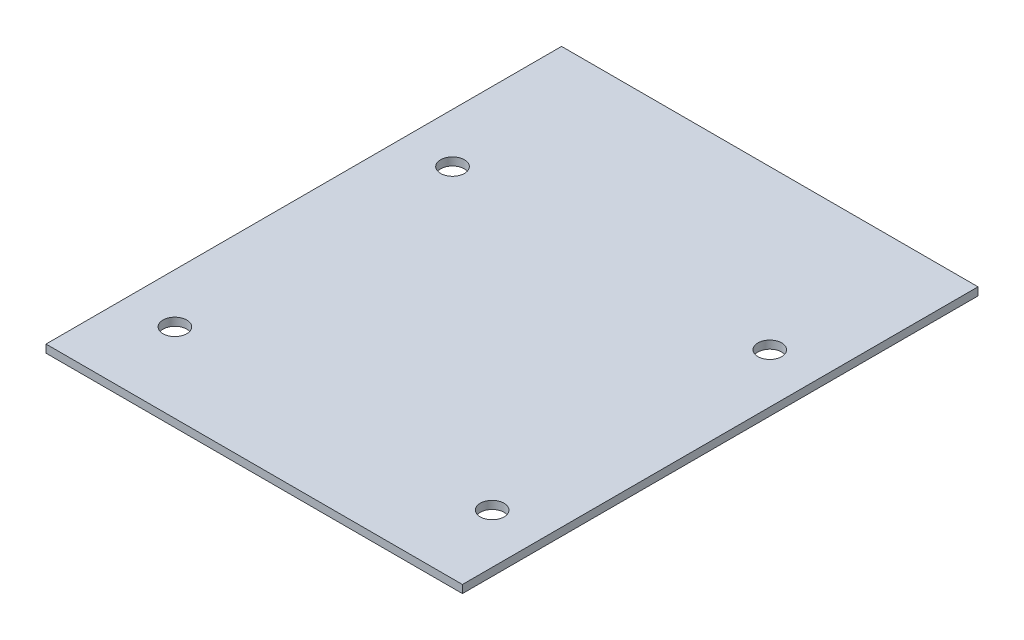
ISO-10303-21;
HEADER;
FILE_DESCRIPTION(('STEP AP214'),'2;1');
FILE_NAME('part.step','',(''),(''),'','','');
FILE_SCHEMA(('AUTOMOTIVE_DESIGN { 1 0 10303 214 1 1 1 1 }'));
ENDSEC;
DATA;
#1=APPLICATION_CONTEXT('core data for automotive mechanical design processes');
#2=APPLICATION_PROTOCOL_DEFINITION('international standard','automotive_design',2000,#1);
#3=PRODUCT_CONTEXT('',#1,'mechanical');
#4=PRODUCT('Part','Part','',(#3));
#5=PRODUCT_RELATED_PRODUCT_CATEGORY('part','',(#4));
#6=PRODUCT_DEFINITION_FORMATION('','',#4);
#7=PRODUCT_DEFINITION_CONTEXT('part definition',#1,'design');
#8=PRODUCT_DEFINITION('design','',#6,#7);
#9=PRODUCT_DEFINITION_SHAPE('','',#8);
#10=(LENGTH_UNIT() NAMED_UNIT(*) SI_UNIT(.MILLI.,.METRE.));
#11=(NAMED_UNIT(*) PLANE_ANGLE_UNIT() SI_UNIT($,.RADIAN.));
#12=(NAMED_UNIT(*) SI_UNIT($,.STERADIAN.) SOLID_ANGLE_UNIT());
#13=UNCERTAINTY_MEASURE_WITH_UNIT(LENGTH_MEASURE(1.E-05),#10,'distance_accuracy_value','');
#14=(GEOMETRIC_REPRESENTATION_CONTEXT(3) GLOBAL_UNCERTAINTY_ASSIGNED_CONTEXT((#13)) GLOBAL_UNIT_ASSIGNED_CONTEXT((#10,
#11,#12)) REPRESENTATION_CONTEXT('',''));
#15=CARTESIAN_POINT('',(0.,0.,0.));
#16=DIRECTION('',(0.,0.,1.));
#17=DIRECTION('',(1.,0.,0.));
#18=AXIS2_PLACEMENT_3D('',#15,#16,#17);
#19=CARTESIAN_POINT('',(105.,553.,405.));
#20=DIRECTION('',(1.,0.,0.));
#21=DIRECTION('',(0.,0.,-1.));
#22=AXIS2_PLACEMENT_3D('',#19,#20,#21);
#23=PLANE('',#22);
#24=DIRECTION('',(0.,1.,0.));
#25=VECTOR('',#24,1.);
#26=CARTESIAN_POINT('',(105.,553.,405.));
#27=LINE('',#26,#25);
#28=CARTESIAN_POINT('',(105.,549.,405.));
#29=VERTEX_POINT('',#28);
#30=CARTESIAN_POINT('',(105.,553.,405.));
#31=VERTEX_POINT('',#30);
#32=EDGE_CURVE('E11',#29,#31,#27,.T.);
#33=ORIENTED_EDGE('',*,*,#32,.F.);
#34=DIRECTION('',(0.,0.,1.));
#35=VECTOR('',#34,1.);
#36=CARTESIAN_POINT('',(105.,549.,0.));
#37=LINE('',#36,#35);
#38=CARTESIAN_POINT('',(105.,549.,145.));
#39=VERTEX_POINT('',#38);
#40=EDGE_CURVE('E91',#29,#39,#37,.F.);
#41=ORIENTED_EDGE('',*,*,#40,.T.);
#42=DIRECTION('',(0.,1.,0.));
#43=VECTOR('',#42,1.);
#44=CARTESIAN_POINT('',(105.,553.,145.));
#45=LINE('',#44,#43);
#46=CARTESIAN_POINT('',(105.,553.,145.));
#47=VERTEX_POINT('',#46);
#48=EDGE_CURVE('E47',#39,#47,#45,.T.);
#49=ORIENTED_EDGE('',*,*,#48,.T.);
#50=DIRECTION('',(0.,0.,-1.));
#51=VECTOR('',#50,1.);
#52=CARTESIAN_POINT('',(105.,553.,405.));
#53=LINE('',#52,#51);
#54=EDGE_CURVE('E107',#31,#47,#53,.T.);
#55=ORIENTED_EDGE('',*,*,#54,.F.);
#56=EDGE_LOOP('',(#33,#41,#49,#55));
#57=FACE_BOUND('',#56,.T.);
#58=ADVANCED_FACE('F37',(#57),#23,.T.);
#59=CARTESIAN_POINT('',(105.,553.,145.));
#60=DIRECTION('',(0.,0.,-1.));
#61=DIRECTION('',(-1.,0.,0.));
#62=AXIS2_PLACEMENT_3D('',#59,#60,#61);
#63=PLANE('',#62);
#64=ORIENTED_EDGE('',*,*,#48,.F.);
#65=DIRECTION('',(1.,0.,0.));
#66=VECTOR('',#65,1.);
#67=CARTESIAN_POINT('',(0.,549.,145.));
#68=LINE('',#67,#66);
#69=CARTESIAN_POINT('',(-105.,549.,145.));
#70=VERTEX_POINT('',#69);
#71=EDGE_CURVE('E101',#39,#70,#68,.F.);
#72=ORIENTED_EDGE('',*,*,#71,.T.);
#73=DIRECTION('',(0.,1.,0.));
#74=VECTOR('',#73,1.);
#75=CARTESIAN_POINT('',(-105.,553.,145.));
#76=LINE('',#75,#74);
#77=CARTESIAN_POINT('',(-105.,553.,145.));
#78=VERTEX_POINT('',#77);
#79=EDGE_CURVE('E55',#70,#78,#76,.T.);
#80=ORIENTED_EDGE('',*,*,#79,.T.);
#81=DIRECTION('',(-1.,0.,0.));
#82=VECTOR('',#81,1.);
#83=CARTESIAN_POINT('',(105.,553.,145.));
#84=LINE('',#83,#82);
#85=EDGE_CURVE('E85',#47,#78,#84,.T.);
#86=ORIENTED_EDGE('',*,*,#85,.F.);
#87=EDGE_LOOP('',(#64,#72,#80,#86));
#88=FACE_BOUND('',#87,.T.);
#89=ADVANCED_FACE('F112',(#88),#63,.T.);
#90=CARTESIAN_POINT('',(-105.,553.,405.));
#91=DIRECTION('',(-1.,0.,0.));
#92=DIRECTION('',(0.,0.,1.));
#93=AXIS2_PLACEMENT_3D('',#90,#91,#92);
#94=PLANE('',#93);
#95=ORIENTED_EDGE('',*,*,#79,.F.);
#96=DIRECTION('',(0.,0.,1.));
#97=VECTOR('',#96,1.);
#98=CARTESIAN_POINT('',(-105.,549.,0.));
#99=LINE('',#98,#97);
#100=CARTESIAN_POINT('',(-105.,549.,405.));
#101=VERTEX_POINT('',#100);
#102=EDGE_CURVE('E90',#70,#101,#99,.T.);
#103=ORIENTED_EDGE('',*,*,#102,.T.);
#104=DIRECTION('',(0.,1.,0.));
#105=VECTOR('',#104,1.);
#106=CARTESIAN_POINT('',(-105.,553.,405.));
#107=LINE('',#106,#105);
#108=CARTESIAN_POINT('',(-105.,553.,405.));
#109=VERTEX_POINT('',#108);
#110=EDGE_CURVE('E41',#101,#109,#107,.T.);
#111=ORIENTED_EDGE('',*,*,#110,.T.);
#112=DIRECTION('',(0.,0.,1.));
#113=VECTOR('',#112,1.);
#114=CARTESIAN_POINT('',(-105.,553.,405.));
#115=LINE('',#114,#113);
#116=EDGE_CURVE('E179',#78,#109,#115,.T.);
#117=ORIENTED_EDGE('',*,*,#116,.F.);
#118=EDGE_LOOP('',(#95,#103,#111,#117));
#119=FACE_BOUND('',#118,.T.);
#120=ADVANCED_FACE('F93',(#119),#94,.T.);
#121=CARTESIAN_POINT('',(-80.,553.,225.));
#122=DIRECTION('',(0.,1.,0.));
#123=DIRECTION('',(0.,0.,1.));
#124=AXIS2_PLACEMENT_3D('',#121,#122,#123);
#125=CYLINDRICAL_SURFACE('',#124,5.99999999999989);
#126=CARTESIAN_POINT('',(-80.,553.,225.));
#127=DIRECTION('',(0.,1.,0.));
#128=DIRECTION('',(0.,0.,1.));
#129=AXIS2_PLACEMENT_3D('',#126,#127,#128);
#130=CIRCLE('',#129,5.99999999999989);
#131=CARTESIAN_POINT('',(-80.,553.,231.));
#132=VERTEX_POINT('',#131);
#133=EDGE_CURVE('E103',#132,#132,#130,.T.);
#134=ORIENTED_EDGE('',*,*,#133,.T.);
#135=EDGE_LOOP('',(#134));
#136=FACE_BOUND('',#135,.T.);
#137=CARTESIAN_POINT('',(-80.,549.,225.));
#138=DIRECTION('',(0.,1.,0.));
#139=DIRECTION('',(0.,0.,1.));
#140=AXIS2_PLACEMENT_3D('',#137,#138,#139);
#141=CIRCLE('',#140,5.99999999999989);
#142=CARTESIAN_POINT('',(-80.,549.,231.));
#143=VERTEX_POINT('',#142);
#144=EDGE_CURVE('E116',#143,#143,#141,.T.);
#145=ORIENTED_EDGE('',*,*,#144,.F.);
#146=EDGE_LOOP('',(#145));
#147=FACE_BOUND('',#146,.T.);
#148=ADVANCED_FACE('F138',(#136,#147),#125,.F.);
#149=CARTESIAN_POINT('',(80.,553.,225.));
#150=DIRECTION('',(0.,1.,0.));
#151=DIRECTION('',(0.,0.,1.));
#152=AXIS2_PLACEMENT_3D('',#149,#150,#151);
#153=CYLINDRICAL_SURFACE('',#152,5.99999999999989);
#154=CARTESIAN_POINT('',(80.,553.,225.));
#155=DIRECTION('',(0.,1.,0.));
#156=DIRECTION('',(0.,0.,1.));
#157=AXIS2_PLACEMENT_3D('',#154,#155,#156);
#158=CIRCLE('',#157,5.99999999999989);
#159=CARTESIAN_POINT('',(80.,553.,231.));
#160=VERTEX_POINT('',#159);
#161=EDGE_CURVE('E172',#160,#160,#158,.T.);
#162=ORIENTED_EDGE('',*,*,#161,.T.);
#163=EDGE_LOOP('',(#162));
#164=FACE_BOUND('',#163,.T.);
#165=CARTESIAN_POINT('',(80.,549.,225.));
#166=DIRECTION('',(0.,1.,0.));
#167=DIRECTION('',(0.,0.,1.));
#168=AXIS2_PLACEMENT_3D('',#165,#166,#167);
#169=CIRCLE('',#168,5.99999999999989);
#170=CARTESIAN_POINT('',(80.,549.,231.));
#171=VERTEX_POINT('',#170);
#172=EDGE_CURVE('E119',#171,#171,#169,.T.);
#173=ORIENTED_EDGE('',*,*,#172,.F.);
#174=EDGE_LOOP('',(#173));
#175=FACE_BOUND('',#174,.T.);
#176=ADVANCED_FACE('F129',(#164,#175),#153,.F.);
#177=CARTESIAN_POINT('',(80.,553.,365.));
#178=DIRECTION('',(0.,1.,0.));
#179=DIRECTION('',(0.,0.,1.));
#180=AXIS2_PLACEMENT_3D('',#177,#178,#179);
#181=CYLINDRICAL_SURFACE('',#180,5.99999999999989);
#182=CARTESIAN_POINT('',(80.,553.,365.));
#183=DIRECTION('',(0.,1.,0.));
#184=DIRECTION('',(0.,0.,1.));
#185=AXIS2_PLACEMENT_3D('',#182,#183,#184);
#186=CIRCLE('',#185,5.99999999999989);
#187=CARTESIAN_POINT('',(80.,553.,371.));
#188=VERTEX_POINT('',#187);
#189=EDGE_CURVE('E175',#188,#188,#186,.T.);
#190=ORIENTED_EDGE('',*,*,#189,.T.);
#191=EDGE_LOOP('',(#190));
#192=FACE_BOUND('',#191,.T.);
#193=CARTESIAN_POINT('',(80.,549.,365.));
#194=DIRECTION('',(0.,1.,0.));
#195=DIRECTION('',(0.,0.,1.));
#196=AXIS2_PLACEMENT_3D('',#193,#194,#195);
#197=CIRCLE('',#196,5.99999999999989);
#198=CARTESIAN_POINT('',(80.,549.,371.));
#199=VERTEX_POINT('',#198);
#200=EDGE_CURVE('E97',#199,#199,#197,.T.);
#201=ORIENTED_EDGE('',*,*,#200,.F.);
#202=EDGE_LOOP('',(#201));
#203=FACE_BOUND('',#202,.T.);
#204=ADVANCED_FACE('F126',(#192,#203),#181,.F.);
#205=CARTESIAN_POINT('',(-80.,553.,365.));
#206=DIRECTION('',(0.,1.,0.));
#207=DIRECTION('',(0.,0.,1.));
#208=AXIS2_PLACEMENT_3D('',#205,#206,#207);
#209=CYLINDRICAL_SURFACE('',#208,5.99999999999989);
#210=CARTESIAN_POINT('',(-80.,553.,365.));
#211=DIRECTION('',(0.,1.,0.));
#212=DIRECTION('',(0.,0.,1.));
#213=AXIS2_PLACEMENT_3D('',#210,#211,#212);
#214=CIRCLE('',#213,5.99999999999989);
#215=CARTESIAN_POINT('',(-80.,553.,371.));
#216=VERTEX_POINT('',#215);
#217=EDGE_CURVE('E178',#216,#216,#214,.T.);
#218=ORIENTED_EDGE('',*,*,#217,.T.);
#219=EDGE_LOOP('',(#218));
#220=FACE_BOUND('',#219,.T.);
#221=CARTESIAN_POINT('',(-80.,549.,365.));
#222=DIRECTION('',(0.,1.,0.));
#223=DIRECTION('',(0.,0.,1.));
#224=AXIS2_PLACEMENT_3D('',#221,#222,#223);
#225=CIRCLE('',#224,5.99999999999989);
#226=CARTESIAN_POINT('',(-80.,549.,371.));
#227=VERTEX_POINT('',#226);
#228=EDGE_CURVE('E94',#227,#227,#225,.T.);
#229=ORIENTED_EDGE('',*,*,#228,.F.);
#230=EDGE_LOOP('',(#229));
#231=FACE_BOUND('',#230,.T.);
#232=ADVANCED_FACE('F128',(#220,#231),#209,.F.);
#233=CARTESIAN_POINT('',(105.,553.,405.));
#234=DIRECTION('',(0.,0.,1.));
#235=DIRECTION('',(1.,0.,0.));
#236=AXIS2_PLACEMENT_3D('',#233,#234,#235);
#237=PLANE('',#236);
#238=DIRECTION('',(1.,0.,0.));
#239=VECTOR('',#238,1.);
#240=CARTESIAN_POINT('',(0.,549.,405.));
#241=LINE('',#240,#239);
#242=EDGE_CURVE('E79',#101,#29,#241,.T.);
#243=ORIENTED_EDGE('',*,*,#242,.T.);
#244=ORIENTED_EDGE('',*,*,#32,.T.);
#245=DIRECTION('',(1.,0.,0.));
#246=VECTOR('',#245,1.);
#247=CARTESIAN_POINT('',(105.,553.,405.));
#248=LINE('',#247,#246);
#249=EDGE_CURVE('E81',#109,#31,#248,.T.);
#250=ORIENTED_EDGE('',*,*,#249,.F.);
#251=ORIENTED_EDGE('',*,*,#110,.F.);
#252=EDGE_LOOP('',(#243,#244,#250,#251));
#253=FACE_BOUND('',#252,.T.);
#254=ADVANCED_FACE('F39',(#253),#237,.T.);
#255=CARTESIAN_POINT('',(0.,553.,0.));
#256=DIRECTION('',(0.,1.,0.));
#257=DIRECTION('',(0.,0.,1.));
#258=AXIS2_PLACEMENT_3D('',#255,#256,#257);
#259=PLANE('',#258);
#260=ORIENTED_EDGE('',*,*,#133,.F.);
#261=EDGE_LOOP('',(#260));
#262=FACE_BOUND('',#261,.T.);
#263=ORIENTED_EDGE('',*,*,#161,.F.);
#264=EDGE_LOOP('',(#263));
#265=FACE_BOUND('',#264,.T.);
#266=ORIENTED_EDGE('',*,*,#189,.F.);
#267=EDGE_LOOP('',(#266));
#268=FACE_BOUND('',#267,.T.);
#269=ORIENTED_EDGE('',*,*,#217,.F.);
#270=EDGE_LOOP('',(#269));
#271=FACE_BOUND('',#270,.T.);
#272=ORIENTED_EDGE('',*,*,#116,.T.);
#273=ORIENTED_EDGE('',*,*,#249,.T.);
#274=ORIENTED_EDGE('',*,*,#54,.T.);
#275=ORIENTED_EDGE('',*,*,#85,.T.);
#276=EDGE_LOOP('',(#272,#273,#274,#275));
#277=FACE_BOUND('',#276,.T.);
#278=ADVANCED_FACE('F110',(#262,#265,#268,#271,#277),#259,.T.);
#279=CARTESIAN_POINT('',(0.,549.,0.));
#280=DIRECTION('',(0.,1.,0.));
#281=DIRECTION('',(0.,0.,1.));
#282=AXIS2_PLACEMENT_3D('',#279,#280,#281);
#283=PLANE('',#282);
#284=ORIENTED_EDGE('',*,*,#144,.T.);
#285=EDGE_LOOP('',(#284));
#286=FACE_BOUND('',#285,.T.);
#287=ORIENTED_EDGE('',*,*,#172,.T.);
#288=EDGE_LOOP('',(#287));
#289=FACE_BOUND('',#288,.T.);
#290=ORIENTED_EDGE('',*,*,#200,.T.);
#291=EDGE_LOOP('',(#290));
#292=FACE_BOUND('',#291,.T.);
#293=ORIENTED_EDGE('',*,*,#228,.T.);
#294=EDGE_LOOP('',(#293));
#295=FACE_BOUND('',#294,.T.);
#296=ORIENTED_EDGE('',*,*,#102,.F.);
#297=ORIENTED_EDGE('',*,*,#71,.F.);
#298=ORIENTED_EDGE('',*,*,#40,.F.);
#299=ORIENTED_EDGE('',*,*,#242,.F.);
#300=EDGE_LOOP('',(#296,#297,#298,#299));
#301=FACE_BOUND('',#300,.T.);
#302=ADVANCED_FACE('F88',(#286,#289,#292,#295,#301),#283,.F.);
#303=CLOSED_SHELL('',(#58,#89,#120,#148,#176,#204,#232,#254,#278,#302));
#304=MANIFOLD_SOLID_BREP('B2',#303);
#305=ADVANCED_BREP_SHAPE_REPRESENTATION('',(#18,#304),#14);
#306=SHAPE_DEFINITION_REPRESENTATION(#9,#305);
ENDSEC;
END-ISO-10303-21;
